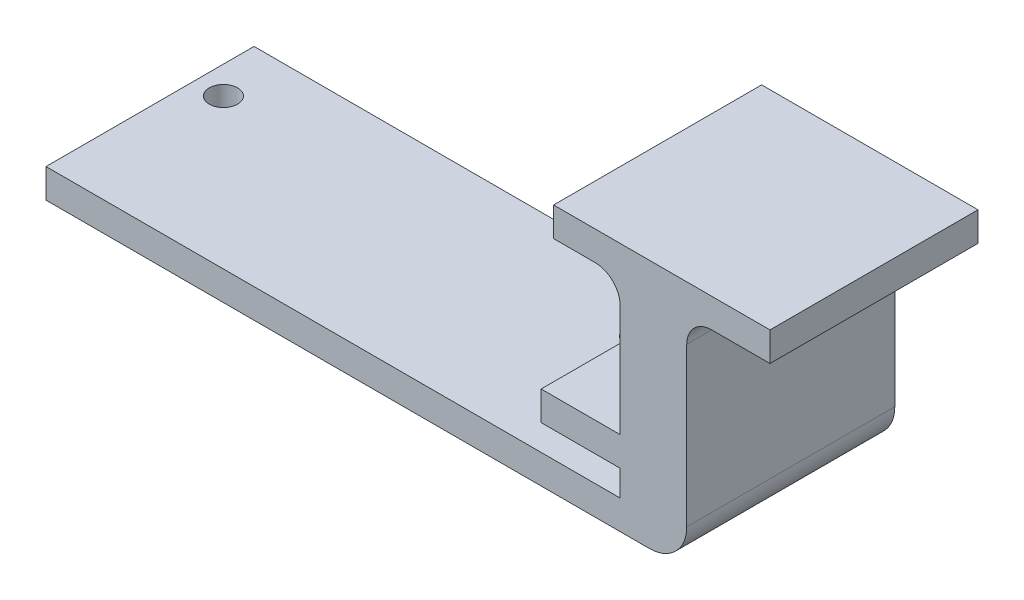
ISO-10303-21;
HEADER;
FILE_DESCRIPTION(('STEP AP214'),'2;1');
FILE_NAME('part.step','',(''),(''),'','','');
FILE_SCHEMA(('AUTOMOTIVE_DESIGN { 1 0 10303 214 1 1 1 1 }'));
ENDSEC;
DATA;
#1=APPLICATION_CONTEXT('core data for automotive mechanical design processes');
#2=APPLICATION_PROTOCOL_DEFINITION('international standard','automotive_design',2000,#1);
#3=PRODUCT_CONTEXT('',#1,'mechanical');
#4=PRODUCT('Part','Part','',(#3));
#5=PRODUCT_RELATED_PRODUCT_CATEGORY('part','',(#4));
#6=PRODUCT_DEFINITION_FORMATION('','',#4);
#7=PRODUCT_DEFINITION_CONTEXT('part definition',#1,'design');
#8=PRODUCT_DEFINITION('design','',#6,#7);
#9=PRODUCT_DEFINITION_SHAPE('','',#8);
#10=(LENGTH_UNIT() NAMED_UNIT(*) SI_UNIT(.MILLI.,.METRE.));
#11=(NAMED_UNIT(*) PLANE_ANGLE_UNIT() SI_UNIT($,.RADIAN.));
#12=(NAMED_UNIT(*) SI_UNIT($,.STERADIAN.) SOLID_ANGLE_UNIT());
#13=UNCERTAINTY_MEASURE_WITH_UNIT(LENGTH_MEASURE(1.E-05),#10,'distance_accuracy_value','');
#14=(GEOMETRIC_REPRESENTATION_CONTEXT(3) GLOBAL_UNCERTAINTY_ASSIGNED_CONTEXT((#13)) GLOBAL_UNIT_ASSIGNED_CONTEXT((#10,
#11,#12)) REPRESENTATION_CONTEXT('',''));
#15=CARTESIAN_POINT('',(0.,0.,0.));
#16=DIRECTION('',(0.,0.,1.));
#17=DIRECTION('',(1.,0.,0.));
#18=AXIS2_PLACEMENT_3D('',#15,#16,#17);
#19=CARTESIAN_POINT('',(62.,18.2919297802475,0.));
#20=DIRECTION('',(1.,0.,0.));
#21=DIRECTION('',(0.,0.,-1.));
#22=AXIS2_PLACEMENT_3D('',#19,#20,#21);
#23=PLANE('',#22);
#24=DIRECTION('',(0.,0.,1.));
#25=VECTOR('',#24,1.);
#26=CARTESIAN_POINT('',(62.,-1.60807021975247,0.));
#27=LINE('',#26,#25);
#28=CARTESIAN_POINT('',(62.,-1.60807021975247,0.));
#29=VERTEX_POINT('',#28);
#30=CARTESIAN_POINT('',(62.,-1.60807021975247,25.));
#31=VERTEX_POINT('',#30);
#32=EDGE_CURVE('E203',#29,#31,#27,.T.);
#33=ORIENTED_EDGE('',*,*,#32,.F.);
#34=DIRECTION('',(0.,-1.,0.));
#35=VECTOR('',#34,1.);
#36=CARTESIAN_POINT('',(62.,18.2919297802475,0.));
#37=LINE('',#36,#35);
#38=CARTESIAN_POINT('',(62.,-4.70807021975246,0.));
#39=VERTEX_POINT('',#38);
#40=EDGE_CURVE('E241',#29,#39,#37,.T.);
#41=ORIENTED_EDGE('',*,*,#40,.T.);
#42=DIRECTION('',(0.,0.,1.));
#43=VECTOR('',#42,1.);
#44=CARTESIAN_POINT('',(62.,-4.70807021975246,0.));
#45=LINE('',#44,#43);
#46=CARTESIAN_POINT('',(62.,-4.70807021975246,25.));
#47=VERTEX_POINT('',#46);
#48=EDGE_CURVE('E235',#39,#47,#45,.T.);
#49=ORIENTED_EDGE('',*,*,#48,.T.);
#50=DIRECTION('',(0.,-1.,0.));
#51=VECTOR('',#50,1.);
#52=CARTESIAN_POINT('',(62.,18.2919297802475,25.));
#53=LINE('',#52,#51);
#54=EDGE_CURVE('E238',#31,#47,#53,.T.);
#55=ORIENTED_EDGE('',*,*,#54,.F.);
#56=EDGE_LOOP('',(#33,#41,#49,#55));
#57=FACE_BOUND('',#56,.T.);
#58=ADVANCED_FACE('F34',(#57),#23,.F.);
#59=CARTESIAN_POINT('',(62.,15.2919297802475,25.));
#60=VERTEX_POINT('',#59);
#61=CARTESIAN_POINT('',(62.,1.89192978024753,25.));
#62=VERTEX_POINT('',#61);
#63=EDGE_CURVE('E239',#60,#62,#53,.T.);
#64=ORIENTED_EDGE('',*,*,#63,.F.);
#65=DIRECTION('',(0.,0.,1.));
#66=VECTOR('',#65,1.);
#67=CARTESIAN_POINT('',(62.,15.2919297802475,0.));
#68=LINE('',#67,#66);
#69=CARTESIAN_POINT('',(62.,15.2919297802475,0.));
#70=VERTEX_POINT('',#69);
#71=EDGE_CURVE('E49',#60,#70,#68,.F.);
#72=ORIENTED_EDGE('',*,*,#71,.T.);
#73=CARTESIAN_POINT('',(62.,1.89192978024753,0.));
#74=VERTEX_POINT('',#73);
#75=EDGE_CURVE('E242',#70,#74,#37,.T.);
#76=ORIENTED_EDGE('',*,*,#75,.T.);
#77=DIRECTION('',(0.,0.,-1.));
#78=VECTOR('',#77,1.);
#79=CARTESIAN_POINT('',(62.,1.89192978024753,0.));
#80=LINE('',#79,#78);
#81=EDGE_CURVE('E213',#62,#74,#80,.T.);
#82=ORIENTED_EDGE('',*,*,#81,.F.);
#83=EDGE_LOOP('',(#64,#72,#76,#82));
#84=FACE_BOUND('',#83,.T.);
#85=ADVANCED_FACE('F314',(#84),#23,.F.);
#86=CARTESIAN_POINT('',(70.,-4.70807021975246,25.));
#87=DIRECTION('',(0.,-1.,0.));
#88=DIRECTION('',(1.,0.,0.));
#89=AXIS2_PLACEMENT_3D('',#86,#87,#88);
#90=PLANE('',#89);
#91=CARTESIAN_POINT('',(46.3197511339118,-4.70807021975246,6.99999999999998));
#92=DIRECTION('',(0.,1.,0.));
#93=DIRECTION('',(-1.,0.,0.));
#94=AXIS2_PLACEMENT_3D('',#91,#92,#93);
#95=CIRCLE('',#94,1.70000000000013);
#96=CARTESIAN_POINT('',(44.6197511339117,-4.70807021975246,6.99999999999998));
#97=VERTEX_POINT('',#96);
#98=EDGE_CURVE('E270',#97,#97,#95,.T.);
#99=ORIENTED_EDGE('',*,*,#98,.F.);
#100=EDGE_LOOP('',(#99));
#101=FACE_BOUND('',#100,.T.);
#102=CARTESIAN_POINT('',(-3.68024886608817,-4.70807021975247,7.00000000000015));
#103=DIRECTION('',(0.,1.,0.));
#104=DIRECTION('',(-1.,0.,0.));
#105=AXIS2_PLACEMENT_3D('',#102,#103,#104);
#106=CIRCLE('',#105,1.70000000000026);
#107=CARTESIAN_POINT('',(-5.38024886608842,-4.70807021975247,7.00000000000015));
#108=VERTEX_POINT('',#107);
#109=EDGE_CURVE('E185',#108,#108,#106,.T.);
#110=ORIENTED_EDGE('',*,*,#109,.F.);
#111=EDGE_LOOP('',(#110));
#112=FACE_BOUND('',#111,.T.);
#113=ORIENTED_EDGE('',*,*,#48,.F.);
#114=DIRECTION('',(-1.,0.,0.));
#115=VECTOR('',#114,1.);
#116=CARTESIAN_POINT('',(70.,-4.70807021975246,0.));
#117=LINE('',#116,#115);
#118=CARTESIAN_POINT('',(-6.99999999999999,-4.70807021975247,0.));
#119=VERTEX_POINT('',#118);
#120=EDGE_CURVE('E257',#39,#119,#117,.T.);
#121=ORIENTED_EDGE('',*,*,#120,.T.);
#122=DIRECTION('',(0.,0.,-1.));
#123=VECTOR('',#122,1.);
#124=CARTESIAN_POINT('',(-6.99999999999999,-4.70807021975247,25.));
#125=LINE('',#124,#123);
#126=CARTESIAN_POINT('',(-6.99999999999999,-4.70807021975247,25.));
#127=VERTEX_POINT('',#126);
#128=EDGE_CURVE('E265',#127,#119,#125,.T.);
#129=ORIENTED_EDGE('',*,*,#128,.F.);
#130=DIRECTION('',(-1.,0.,0.));
#131=VECTOR('',#130,1.);
#132=CARTESIAN_POINT('',(70.,-4.70807021975246,25.));
#133=LINE('',#132,#131);
#134=EDGE_CURVE('E247',#47,#127,#133,.T.);
#135=ORIENTED_EDGE('',*,*,#134,.F.);
#136=EDGE_LOOP('',(#113,#121,#129,#135));
#137=FACE_BOUND('',#136,.T.);
#138=ADVANCED_FACE('F320',(#101,#112,#137),#90,.F.);
#139=CARTESIAN_POINT('',(70.,-4.70807021975246,25.));
#140=DIRECTION('',(-1.,0.,0.));
#141=DIRECTION('',(0.,0.,1.));
#142=AXIS2_PLACEMENT_3D('',#139,#140,#141);
#143=PLANE('',#142);
#144=DIRECTION('',(0.,1.,0.));
#145=VECTOR('',#144,1.);
#146=CARTESIAN_POINT('',(70.,-4.70807021975246,0.));
#147=LINE('',#146,#145);
#148=CARTESIAN_POINT('',(70.,-3.70807021975246,0.));
#149=VERTEX_POINT('',#148);
#150=CARTESIAN_POINT('',(70.,15.2919297802475,0.));
#151=VERTEX_POINT('',#150);
#152=EDGE_CURVE('E244',#149,#151,#147,.T.);
#153=ORIENTED_EDGE('',*,*,#152,.T.);
#154=DIRECTION('',(0.,0.,-1.));
#155=VECTOR('',#154,1.);
#156=CARTESIAN_POINT('',(70.,15.2919297802475,25.));
#157=LINE('',#156,#155);
#158=CARTESIAN_POINT('',(70.,15.2919297802475,25.));
#159=VERTEX_POINT('',#158);
#160=EDGE_CURVE('E282',#151,#159,#157,.F.);
#161=ORIENTED_EDGE('',*,*,#160,.T.);
#162=DIRECTION('',(0.,1.,0.));
#163=VECTOR('',#162,1.);
#164=CARTESIAN_POINT('',(70.,-4.70807021975246,25.));
#165=LINE('',#164,#163);
#166=CARTESIAN_POINT('',(70.,-3.70807021975246,25.));
#167=VERTEX_POINT('',#166);
#168=EDGE_CURVE('E245',#167,#159,#165,.T.);
#169=ORIENTED_EDGE('',*,*,#168,.F.);
#170=DIRECTION('',(0.,0.,-1.));
#171=VECTOR('',#170,1.);
#172=CARTESIAN_POINT('',(70.,-3.70807021975246,25.));
#173=LINE('',#172,#171);
#174=EDGE_CURVE('E268',#167,#149,#173,.T.);
#175=ORIENTED_EDGE('',*,*,#174,.T.);
#176=EDGE_LOOP('',(#153,#161,#169,#175));
#177=FACE_BOUND('',#176,.T.);
#178=ADVANCED_FACE('F336',(#177),#143,.F.);
#179=CARTESIAN_POINT('',(-6.99999999999999,-4.70807021975247,25.));
#180=DIRECTION('',(1.,0.,0.));
#181=DIRECTION('',(0.,0.,-1.));
#182=AXIS2_PLACEMENT_3D('',#179,#180,#181);
#183=PLANE('',#182);
#184=DIRECTION('',(0.,-1.,0.));
#185=VECTOR('',#184,1.);
#186=CARTESIAN_POINT('',(-6.99999999999999,-4.70807021975247,0.));
#187=LINE('',#186,#185);
#188=CARTESIAN_POINT('',(-6.99999999999999,-8.20807021975247,0.));
#189=VERTEX_POINT('',#188);
#190=EDGE_CURVE('E259',#119,#189,#187,.T.);
#191=ORIENTED_EDGE('',*,*,#190,.T.);
#192=DIRECTION('',(0.,0.,-1.));
#193=VECTOR('',#192,1.);
#194=CARTESIAN_POINT('',(-6.99999999999999,-8.20807021975247,25.));
#195=LINE('',#194,#193);
#196=CARTESIAN_POINT('',(-6.99999999999999,-8.20807021975247,25.));
#197=VERTEX_POINT('',#196);
#198=EDGE_CURVE('E254',#197,#189,#195,.T.);
#199=ORIENTED_EDGE('',*,*,#198,.F.);
#200=DIRECTION('',(0.,-1.,0.));
#201=VECTOR('',#200,1.);
#202=CARTESIAN_POINT('',(-6.99999999999999,-4.70807021975247,25.));
#203=LINE('',#202,#201);
#204=EDGE_CURVE('E250',#127,#197,#203,.T.);
#205=ORIENTED_EDGE('',*,*,#204,.F.);
#206=ORIENTED_EDGE('',*,*,#128,.T.);
#207=EDGE_LOOP('',(#191,#199,#205,#206));
#208=FACE_BOUND('',#207,.T.);
#209=ADVANCED_FACE('F332',(#208),#183,.F.);
#210=CARTESIAN_POINT('',(70.,-8.20807021975246,25.));
#211=DIRECTION('',(0.,1.,0.));
#212=DIRECTION('',(-1.,0.,0.));
#213=AXIS2_PLACEMENT_3D('',#210,#211,#212);
#214=PLANE('',#213);
#215=CARTESIAN_POINT('',(46.3197511339118,-8.20807021975246,6.99999999999998));
#216=DIRECTION('',(0.,1.,0.));
#217=DIRECTION('',(-1.,0.,0.));
#218=AXIS2_PLACEMENT_3D('',#215,#216,#217);
#219=CIRCLE('',#218,1.70000000000013);
#220=CARTESIAN_POINT('',(44.6197511339117,-8.20807021975246,6.99999999999998));
#221=VERTEX_POINT('',#220);
#222=EDGE_CURVE('E179',#221,#221,#219,.T.);
#223=ORIENTED_EDGE('',*,*,#222,.T.);
#224=EDGE_LOOP('',(#223));
#225=FACE_BOUND('',#224,.T.);
#226=CARTESIAN_POINT('',(-3.68024886608817,-8.20807021975247,7.00000000000015));
#227=DIRECTION('',(0.,1.,0.));
#228=DIRECTION('',(-1.,0.,0.));
#229=AXIS2_PLACEMENT_3D('',#226,#227,#228);
#230=CIRCLE('',#229,1.70000000000026);
#231=CARTESIAN_POINT('',(-5.38024886608842,-8.20807021975247,7.00000000000015));
#232=VERTEX_POINT('',#231);
#233=EDGE_CURVE('E182',#232,#232,#230,.T.);
#234=ORIENTED_EDGE('',*,*,#233,.T.);
#235=EDGE_LOOP('',(#234));
#236=FACE_BOUND('',#235,.T.);
#237=DIRECTION('',(1.,0.,0.));
#238=VECTOR('',#237,1.);
#239=CARTESIAN_POINT('',(70.,-8.20807021975246,0.));
#240=LINE('',#239,#238);
#241=CARTESIAN_POINT('',(65.5,-8.20807021975246,0.));
#242=VERTEX_POINT('',#241);
#243=EDGE_CURVE('E248',#189,#242,#240,.T.);
#244=ORIENTED_EDGE('',*,*,#243,.T.);
#245=DIRECTION('',(0.,0.,-1.));
#246=VECTOR('',#245,1.);
#247=CARTESIAN_POINT('',(65.5,-8.20807021975246,25.));
#248=LINE('',#247,#246);
#249=CARTESIAN_POINT('',(65.5,-8.20807021975246,25.));
#250=VERTEX_POINT('',#249);
#251=EDGE_CURVE('E276',#242,#250,#248,.F.);
#252=ORIENTED_EDGE('',*,*,#251,.T.);
#253=DIRECTION('',(1.,0.,0.));
#254=VECTOR('',#253,1.);
#255=CARTESIAN_POINT('',(70.,-8.20807021975246,25.));
#256=LINE('',#255,#254);
#257=EDGE_CURVE('E252',#197,#250,#256,.T.);
#258=ORIENTED_EDGE('',*,*,#257,.F.);
#259=ORIENTED_EDGE('',*,*,#198,.T.);
#260=EDGE_LOOP('',(#244,#252,#258,#259));
#261=FACE_BOUND('',#260,.T.);
#262=ADVANCED_FACE('F327',(#225,#236,#261),#214,.F.);
#263=CARTESIAN_POINT('',(0.,0.,25.));
#264=DIRECTION('',(0.,0.,-1.));
#265=DIRECTION('',(-1.,0.,0.));
#266=AXIS2_PLACEMENT_3D('',#263,#264,#265);
#267=PLANE('',#266);
#268=ORIENTED_EDGE('',*,*,#257,.T.);
#269=CARTESIAN_POINT('',(65.5,-3.70807021975246,25.));
#270=DIRECTION('',(0.,0.,-1.));
#271=DIRECTION('',(-1.,0.,0.));
#272=AXIS2_PLACEMENT_3D('',#269,#270,#271);
#273=CIRCLE('',#272,4.5);
#274=EDGE_CURVE('E278',#250,#167,#273,.F.);
#275=ORIENTED_EDGE('',*,*,#274,.T.);
#276=ORIENTED_EDGE('',*,*,#168,.T.);
#277=CARTESIAN_POINT('',(73.,15.2919297802475,25.));
#278=DIRECTION('',(0.,0.,-1.));
#279=DIRECTION('',(-1.,0.,0.));
#280=AXIS2_PLACEMENT_3D('',#277,#278,#279);
#281=CIRCLE('',#280,3.);
#282=CARTESIAN_POINT('',(73.,18.2919297802475,25.));
#283=VERTEX_POINT('',#282);
#284=EDGE_CURVE('E158',#159,#283,#281,.T.);
#285=ORIENTED_EDGE('',*,*,#284,.T.);
#286=DIRECTION('',(1.,0.,0.));
#287=VECTOR('',#286,1.);
#288=CARTESIAN_POINT('',(54.,18.2919297802475,25.));
#289=LINE('',#288,#287);
#290=CARTESIAN_POINT('',(80.,18.2919297802475,25.));
#291=VERTEX_POINT('',#290);
#292=EDGE_CURVE('E150',#283,#291,#289,.T.);
#293=ORIENTED_EDGE('',*,*,#292,.T.);
#294=DIRECTION('',(0.,-1.,0.));
#295=VECTOR('',#294,1.);
#296=CARTESIAN_POINT('',(80.,18.2919297802475,25.));
#297=LINE('',#296,#295);
#298=CARTESIAN_POINT('',(80.,21.7919297802475,25.));
#299=VERTEX_POINT('',#298);
#300=EDGE_CURVE('E155',#299,#291,#297,.T.);
#301=ORIENTED_EDGE('',*,*,#300,.F.);
#302=DIRECTION('',(1.,0.,0.));
#303=VECTOR('',#302,1.);
#304=CARTESIAN_POINT('',(54.,21.7919297802475,25.));
#305=LINE('',#304,#303);
#306=CARTESIAN_POINT('',(54.,21.7919297802475,25.));
#307=VERTEX_POINT('',#306);
#308=EDGE_CURVE('E201',#307,#299,#305,.T.);
#309=ORIENTED_EDGE('',*,*,#308,.F.);
#310=DIRECTION('',(0.,-1.,0.));
#311=VECTOR('',#310,1.);
#312=CARTESIAN_POINT('',(54.,18.2919297802475,25.));
#313=LINE('',#312,#311);
#314=CARTESIAN_POINT('',(54.,18.2919297802475,25.));
#315=VERTEX_POINT('',#314);
#316=EDGE_CURVE('E190',#307,#315,#313,.T.);
#317=ORIENTED_EDGE('',*,*,#316,.T.);
#318=CARTESIAN_POINT('',(59.,18.2919297802475,25.));
#319=VERTEX_POINT('',#318);
#320=EDGE_CURVE('E162',#315,#319,#289,.T.);
#321=ORIENTED_EDGE('',*,*,#320,.T.);
#322=CARTESIAN_POINT('',(59.,15.2919297802475,25.));
#323=DIRECTION('',(0.,0.,-1.));
#324=DIRECTION('',(-1.,0.,0.));
#325=AXIS2_PLACEMENT_3D('',#322,#323,#324);
#326=CIRCLE('',#325,3.);
#327=EDGE_CURVE('E42',#319,#60,#326,.T.);
#328=ORIENTED_EDGE('',*,*,#327,.T.);
#329=ORIENTED_EDGE('',*,*,#63,.T.);
#330=DIRECTION('',(1.,0.,0.));
#331=VECTOR('',#330,1.);
#332=CARTESIAN_POINT('',(52.5,1.89192978024753,25.));
#333=LINE('',#332,#331);
#334=CARTESIAN_POINT('',(52.5,1.89192978024753,25.));
#335=VERTEX_POINT('',#334);
#336=EDGE_CURVE('E226',#335,#62,#333,.T.);
#337=ORIENTED_EDGE('',*,*,#336,.F.);
#338=DIRECTION('',(0.,1.,0.));
#339=VECTOR('',#338,1.);
#340=CARTESIAN_POINT('',(52.5,-1.60807021975247,25.));
#341=LINE('',#340,#339);
#342=CARTESIAN_POINT('',(52.5,-1.60807021975247,25.));
#343=VERTEX_POINT('',#342);
#344=EDGE_CURVE('E215',#343,#335,#341,.T.);
#345=ORIENTED_EDGE('',*,*,#344,.F.);
#346=DIRECTION('',(1.,0.,0.));
#347=VECTOR('',#346,1.);
#348=CARTESIAN_POINT('',(52.5,-1.60807021975247,25.));
#349=LINE('',#348,#347);
#350=EDGE_CURVE('E229',#343,#31,#349,.T.);
#351=ORIENTED_EDGE('',*,*,#350,.T.);
#352=ORIENTED_EDGE('',*,*,#54,.T.);
#353=ORIENTED_EDGE('',*,*,#134,.T.);
#354=ORIENTED_EDGE('',*,*,#204,.T.);
#355=EDGE_LOOP('',(#268,#275,#276,#285,#293,#301,#309,#317,#321,#328,#329,#337,#345,#351,#352,
#353,#354));
#356=FACE_BOUND('',#355,.T.);
#357=ADVANCED_FACE('F153',(#356),#267,.F.);
#358=CARTESIAN_POINT('',(0.,0.,0.));
#359=DIRECTION('',(0.,0.,-1.));
#360=DIRECTION('',(-1.,0.,0.));
#361=AXIS2_PLACEMENT_3D('',#358,#359,#360);
#362=PLANE('',#361);
#363=ORIENTED_EDGE('',*,*,#152,.F.);
#364=CARTESIAN_POINT('',(65.5,-3.70807021975246,0.));
#365=DIRECTION('',(0.,0.,-1.));
#366=DIRECTION('',(-1.,0.,0.));
#367=AXIS2_PLACEMENT_3D('',#364,#365,#366);
#368=CIRCLE('',#367,4.5);
#369=EDGE_CURVE('E274',#149,#242,#368,.T.);
#370=ORIENTED_EDGE('',*,*,#369,.T.);
#371=ORIENTED_EDGE('',*,*,#243,.F.);
#372=ORIENTED_EDGE('',*,*,#190,.F.);
#373=ORIENTED_EDGE('',*,*,#120,.F.);
#374=ORIENTED_EDGE('',*,*,#40,.F.);
#375=DIRECTION('',(1.,0.,0.));
#376=VECTOR('',#375,1.);
#377=CARTESIAN_POINT('',(52.5,-1.60807021975247,0.));
#378=LINE('',#377,#376);
#379=CARTESIAN_POINT('',(52.5,-1.60807021975247,0.));
#380=VERTEX_POINT('',#379);
#381=EDGE_CURVE('E232',#380,#29,#378,.T.);
#382=ORIENTED_EDGE('',*,*,#381,.F.);
#383=DIRECTION('',(0.,-1.,0.));
#384=VECTOR('',#383,1.);
#385=CARTESIAN_POINT('',(52.5,-1.60807021975247,0.));
#386=LINE('',#385,#384);
#387=CARTESIAN_POINT('',(52.5,1.89192978024753,0.));
#388=VERTEX_POINT('',#387);
#389=EDGE_CURVE('E209',#388,#380,#386,.T.);
#390=ORIENTED_EDGE('',*,*,#389,.F.);
#391=DIRECTION('',(1.,0.,0.));
#392=VECTOR('',#391,1.);
#393=CARTESIAN_POINT('',(52.5,1.89192978024753,0.));
#394=LINE('',#393,#392);
#395=EDGE_CURVE('E219',#388,#74,#394,.T.);
#396=ORIENTED_EDGE('',*,*,#395,.T.);
#397=ORIENTED_EDGE('',*,*,#75,.F.);
#398=CARTESIAN_POINT('',(59.,15.2919297802475,0.));
#399=DIRECTION('',(0.,0.,-1.));
#400=DIRECTION('',(-1.,0.,0.));
#401=AXIS2_PLACEMENT_3D('',#398,#399,#400);
#402=CIRCLE('',#401,3.);
#403=CARTESIAN_POINT('',(59.,18.2919297802475,0.));
#404=VERTEX_POINT('',#403);
#405=EDGE_CURVE('E11',#70,#404,#402,.F.);
#406=ORIENTED_EDGE('',*,*,#405,.T.);
#407=DIRECTION('',(1.,0.,0.));
#408=VECTOR('',#407,1.);
#409=CARTESIAN_POINT('',(54.,18.2919297802475,0.));
#410=LINE('',#409,#408);
#411=CARTESIAN_POINT('',(54.,18.2919297802475,0.));
#412=VERTEX_POINT('',#411);
#413=EDGE_CURVE('E206',#412,#404,#410,.T.);
#414=ORIENTED_EDGE('',*,*,#413,.F.);
#415=DIRECTION('',(0.,1.,0.));
#416=VECTOR('',#415,1.);
#417=CARTESIAN_POINT('',(54.,18.2919297802475,0.));
#418=LINE('',#417,#416);
#419=CARTESIAN_POINT('',(54.,21.7919297802475,0.));
#420=VERTEX_POINT('',#419);
#421=EDGE_CURVE('E196',#412,#420,#418,.T.);
#422=ORIENTED_EDGE('',*,*,#421,.T.);
#423=DIRECTION('',(1.,0.,0.));
#424=VECTOR('',#423,1.);
#425=CARTESIAN_POINT('',(54.,21.7919297802475,0.));
#426=LINE('',#425,#424);
#427=CARTESIAN_POINT('',(80.,21.7919297802475,0.));
#428=VERTEX_POINT('',#427);
#429=EDGE_CURVE('E204',#420,#428,#426,.T.);
#430=ORIENTED_EDGE('',*,*,#429,.T.);
#431=DIRECTION('',(0.,1.,0.));
#432=VECTOR('',#431,1.);
#433=CARTESIAN_POINT('',(80.,18.2919297802475,0.));
#434=LINE('',#433,#432);
#435=CARTESIAN_POINT('',(80.,18.2919297802475,0.));
#436=VERTEX_POINT('',#435);
#437=EDGE_CURVE('E173',#436,#428,#434,.T.);
#438=ORIENTED_EDGE('',*,*,#437,.F.);
#439=CARTESIAN_POINT('',(73.,18.2919297802475,0.));
#440=VERTEX_POINT('',#439);
#441=EDGE_CURVE('E169',#440,#436,#410,.T.);
#442=ORIENTED_EDGE('',*,*,#441,.F.);
#443=CARTESIAN_POINT('',(73.,15.2919297802475,0.));
#444=DIRECTION('',(0.,0.,-1.));
#445=DIRECTION('',(-1.,0.,0.));
#446=AXIS2_PLACEMENT_3D('',#443,#444,#445);
#447=CIRCLE('',#446,3.);
#448=EDGE_CURVE('E284',#440,#151,#447,.F.);
#449=ORIENTED_EDGE('',*,*,#448,.T.);
#450=EDGE_LOOP('',(#363,#370,#371,#372,#373,#374,#382,#390,#396,#397,#406,#414,#422,#430,#438,
#442,#449));
#451=FACE_BOUND('',#450,.T.);
#452=ADVANCED_FACE('F305',(#451),#362,.T.);
#453=CARTESIAN_POINT('',(52.5,-1.60807021975247,0.));
#454=DIRECTION('',(0.,1.,0.));
#455=DIRECTION('',(-1.,0.,0.));
#456=AXIS2_PLACEMENT_3D('',#453,#454,#455);
#457=PLANE('',#456);
#458=ORIENTED_EDGE('',*,*,#32,.T.);
#459=ORIENTED_EDGE('',*,*,#350,.F.);
#460=DIRECTION('',(0.,0.,1.));
#461=VECTOR('',#460,1.);
#462=CARTESIAN_POINT('',(52.5,-1.60807021975247,0.));
#463=LINE('',#462,#461);
#464=EDGE_CURVE('E212',#380,#343,#463,.T.);
#465=ORIENTED_EDGE('',*,*,#464,.F.);
#466=ORIENTED_EDGE('',*,*,#381,.T.);
#467=EDGE_LOOP('',(#458,#459,#465,#466));
#468=FACE_BOUND('',#467,.T.);
#469=ADVANCED_FACE('F323',(#468),#457,.F.);
#470=CARTESIAN_POINT('',(52.5,1.89192978024753,0.));
#471=DIRECTION('',(0.,-1.,0.));
#472=DIRECTION('',(1.,0.,0.));
#473=AXIS2_PLACEMENT_3D('',#470,#471,#472);
#474=PLANE('',#473);
#475=ORIENTED_EDGE('',*,*,#81,.T.);
#476=ORIENTED_EDGE('',*,*,#395,.F.);
#477=DIRECTION('',(0.,0.,-1.));
#478=VECTOR('',#477,1.);
#479=CARTESIAN_POINT('',(52.5,1.89192978024753,0.));
#480=LINE('',#479,#478);
#481=EDGE_CURVE('E217',#335,#388,#480,.T.);
#482=ORIENTED_EDGE('',*,*,#481,.F.);
#483=ORIENTED_EDGE('',*,*,#336,.T.);
#484=EDGE_LOOP('',(#475,#476,#482,#483));
#485=FACE_BOUND('',#484,.T.);
#486=ADVANCED_FACE('F381',(#485),#474,.F.);
#487=CARTESIAN_POINT('',(52.5,0.,0.));
#488=DIRECTION('',(1.,0.,0.));
#489=DIRECTION('',(0.,0.,-1.));
#490=AXIS2_PLACEMENT_3D('',#487,#488,#489);
#491=PLANE('',#490);
#492=ORIENTED_EDGE('',*,*,#389,.T.);
#493=ORIENTED_EDGE('',*,*,#464,.T.);
#494=ORIENTED_EDGE('',*,*,#344,.T.);
#495=ORIENTED_EDGE('',*,*,#481,.T.);
#496=EDGE_LOOP('',(#492,#493,#494,#495));
#497=FACE_BOUND('',#496,.T.);
#498=ADVANCED_FACE('F377',(#497),#491,.F.);
#499=CARTESIAN_POINT('',(54.,18.2919297802475,25.));
#500=DIRECTION('',(0.,-1.,0.));
#501=DIRECTION('',(0.,0.,-1.));
#502=AXIS2_PLACEMENT_3D('',#499,#500,#501);
#503=PLANE('',#502);
#504=ORIENTED_EDGE('',*,*,#292,.F.);
#505=DIRECTION('',(0.,0.,-1.));
#506=VECTOR('',#505,1.);
#507=CARTESIAN_POINT('',(73.,18.2919297802475,25.));
#508=LINE('',#507,#506);
#509=EDGE_CURVE('E280',#283,#440,#508,.T.);
#510=ORIENTED_EDGE('',*,*,#509,.T.);
#511=ORIENTED_EDGE('',*,*,#441,.T.);
#512=DIRECTION('',(0.,0.,-1.));
#513=VECTOR('',#512,1.);
#514=CARTESIAN_POINT('',(80.,18.2919297802475,25.));
#515=LINE('',#514,#513);
#516=EDGE_CURVE('E166',#291,#436,#515,.T.);
#517=ORIENTED_EDGE('',*,*,#516,.F.);
#518=EDGE_LOOP('',(#504,#510,#511,#517));
#519=FACE_BOUND('',#518,.T.);
#520=ADVANCED_FACE('F167',(#519),#503,.T.);
#521=CARTESIAN_POINT('',(54.,21.7919297802475,25.));
#522=DIRECTION('',(0.,1.,0.));
#523=DIRECTION('',(0.,0.,1.));
#524=AXIS2_PLACEMENT_3D('',#521,#522,#523);
#525=PLANE('',#524);
#526=ORIENTED_EDGE('',*,*,#308,.T.);
#527=DIRECTION('',(0.,0.,1.));
#528=VECTOR('',#527,1.);
#529=CARTESIAN_POINT('',(80.,21.7919297802475,25.));
#530=LINE('',#529,#528);
#531=EDGE_CURVE('E178',#428,#299,#530,.T.);
#532=ORIENTED_EDGE('',*,*,#531,.F.);
#533=ORIENTED_EDGE('',*,*,#429,.F.);
#534=DIRECTION('',(0.,0.,1.));
#535=VECTOR('',#534,1.);
#536=CARTESIAN_POINT('',(54.,21.7919297802475,25.));
#537=LINE('',#536,#535);
#538=EDGE_CURVE('E163',#420,#307,#537,.T.);
#539=ORIENTED_EDGE('',*,*,#538,.T.);
#540=EDGE_LOOP('',(#526,#532,#533,#539));
#541=FACE_BOUND('',#540,.T.);
#542=ADVANCED_FACE('F302',(#541),#525,.T.);
#543=ORIENTED_EDGE('',*,*,#413,.T.);
#544=DIRECTION('',(0.,0.,1.));
#545=VECTOR('',#544,1.);
#546=CARTESIAN_POINT('',(59.,18.2919297802475,25.));
#547=LINE('',#546,#545);
#548=EDGE_CURVE('E287',#404,#319,#547,.T.);
#549=ORIENTED_EDGE('',*,*,#548,.T.);
#550=ORIENTED_EDGE('',*,*,#320,.F.);
#551=DIRECTION('',(0.,0.,-1.));
#552=VECTOR('',#551,1.);
#553=CARTESIAN_POINT('',(54.,18.2919297802475,25.));
#554=LINE('',#553,#552);
#555=EDGE_CURVE('E193',#315,#412,#554,.T.);
#556=ORIENTED_EDGE('',*,*,#555,.T.);
#557=EDGE_LOOP('',(#543,#549,#550,#556));
#558=FACE_BOUND('',#557,.T.);
#559=ADVANCED_FACE('F292',(#558),#503,.T.);
#560=CARTESIAN_POINT('',(54.,0.,0.));
#561=DIRECTION('',(-1.,0.,0.));
#562=DIRECTION('',(0.,0.,1.));
#563=AXIS2_PLACEMENT_3D('',#560,#561,#562);
#564=PLANE('',#563);
#565=ORIENTED_EDGE('',*,*,#316,.F.);
#566=ORIENTED_EDGE('',*,*,#538,.F.);
#567=ORIENTED_EDGE('',*,*,#421,.F.);
#568=ORIENTED_EDGE('',*,*,#555,.F.);
#569=EDGE_LOOP('',(#565,#566,#567,#568));
#570=FACE_BOUND('',#569,.T.);
#571=ADVANCED_FACE('F299',(#570),#564,.T.);
#572=CARTESIAN_POINT('',(80.,0.,0.));
#573=DIRECTION('',(-1.,0.,0.));
#574=DIRECTION('',(0.,0.,1.));
#575=AXIS2_PLACEMENT_3D('',#572,#573,#574);
#576=PLANE('',#575);
#577=ORIENTED_EDGE('',*,*,#300,.T.);
#578=ORIENTED_EDGE('',*,*,#516,.T.);
#579=ORIENTED_EDGE('',*,*,#437,.T.);
#580=ORIENTED_EDGE('',*,*,#531,.T.);
#581=EDGE_LOOP('',(#577,#578,#579,#580));
#582=FACE_BOUND('',#581,.T.);
#583=ADVANCED_FACE('F176',(#582),#576,.F.);
#584=CARTESIAN_POINT('',(-3.68024886608817,-12.7080702197525,7.00000000000015));
#585=DIRECTION('',(0.,1.,0.));
#586=DIRECTION('',(-1.,0.,0.));
#587=AXIS2_PLACEMENT_3D('',#584,#585,#586);
#588=CYLINDRICAL_SURFACE('',#587,1.70000000000026);
#589=ORIENTED_EDGE('',*,*,#109,.T.);
#590=EDGE_LOOP('',(#589));
#591=FACE_BOUND('',#590,.T.);
#592=ORIENTED_EDGE('',*,*,#233,.F.);
#593=EDGE_LOOP('',(#592));
#594=FACE_BOUND('',#593,.T.);
#595=ADVANCED_FACE('F350',(#591,#594),#588,.F.);
#596=CARTESIAN_POINT('',(46.3197511339118,-12.7080702197525,6.99999999999998));
#597=DIRECTION('',(0.,1.,0.));
#598=DIRECTION('',(-1.,0.,0.));
#599=AXIS2_PLACEMENT_3D('',#596,#597,#598);
#600=CYLINDRICAL_SURFACE('',#599,1.70000000000013);
#601=ORIENTED_EDGE('',*,*,#98,.T.);
#602=EDGE_LOOP('',(#601));
#603=FACE_BOUND('',#602,.T.);
#604=ORIENTED_EDGE('',*,*,#222,.F.);
#605=EDGE_LOOP('',(#604));
#606=FACE_BOUND('',#605,.T.);
#607=ADVANCED_FACE('F345',(#603,#606),#600,.F.);
#608=CARTESIAN_POINT('',(65.5,-3.70807021975246,25.));
#609=DIRECTION('',(0.,0.,-1.));
#610=DIRECTION('',(-1.,0.,0.));
#611=AXIS2_PLACEMENT_3D('',#608,#609,#610);
#612=CYLINDRICAL_SURFACE('',#611,4.5);
#613=ORIENTED_EDGE('',*,*,#274,.F.);
#614=ORIENTED_EDGE('',*,*,#251,.F.);
#615=ORIENTED_EDGE('',*,*,#369,.F.);
#616=ORIENTED_EDGE('',*,*,#174,.F.);
#617=EDGE_LOOP('',(#613,#614,#615,#616));
#618=FACE_BOUND('',#617,.T.);
#619=ADVANCED_FACE('F311',(#618),#612,.T.);
#620=CARTESIAN_POINT('',(73.,15.2919297802475,25.));
#621=DIRECTION('',(0.,0.,-1.));
#622=DIRECTION('',(-1.,0.,0.));
#623=AXIS2_PLACEMENT_3D('',#620,#621,#622);
#624=CYLINDRICAL_SURFACE('',#623,3.);
#625=ORIENTED_EDGE('',*,*,#284,.F.);
#626=ORIENTED_EDGE('',*,*,#160,.F.);
#627=ORIENTED_EDGE('',*,*,#448,.F.);
#628=ORIENTED_EDGE('',*,*,#509,.F.);
#629=EDGE_LOOP('',(#625,#626,#627,#628));
#630=FACE_BOUND('',#629,.T.);
#631=ADVANCED_FACE('F307',(#630),#624,.F.);
#632=CARTESIAN_POINT('',(59.,15.2919297802475,25.));
#633=DIRECTION('',(0.,0.,1.));
#634=DIRECTION('',(1.,0.,0.));
#635=AXIS2_PLACEMENT_3D('',#632,#633,#634);
#636=CYLINDRICAL_SURFACE('',#635,3.);
#637=ORIENTED_EDGE('',*,*,#405,.F.);
#638=ORIENTED_EDGE('',*,*,#71,.F.);
#639=ORIENTED_EDGE('',*,*,#327,.F.);
#640=ORIENTED_EDGE('',*,*,#548,.F.);
#641=EDGE_LOOP('',(#637,#638,#639,#640));
#642=FACE_BOUND('',#641,.T.);
#643=ADVANCED_FACE('F36',(#642),#636,.F.);
#644=CLOSED_SHELL('',(#58,#85,#138,#178,#209,#262,#357,#452,#469,#486,#498,#520,#542,#559,#571,
#583,#595,#607,#619,#631,#643));
#645=MANIFOLD_SOLID_BREP('B2',#644);
#646=ADVANCED_BREP_SHAPE_REPRESENTATION('',(#18,#645),#14);
#647=SHAPE_DEFINITION_REPRESENTATION(#9,#646);
ENDSEC;
END-ISO-10303-21;
